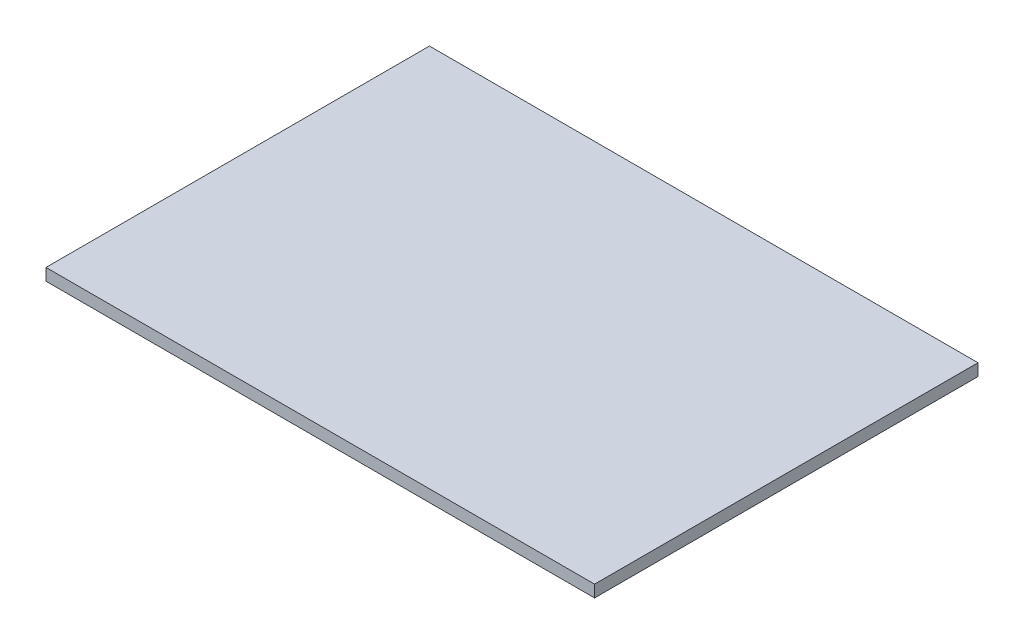
ISO-10303-21;
HEADER;
FILE_DESCRIPTION(('STEP AP214'),'2;1');
FILE_NAME('part.step','',(''),(''),'','','');
FILE_SCHEMA(('AUTOMOTIVE_DESIGN { 1 0 10303 214 1 1 1 1 }'));
ENDSEC;
DATA;
#1=APPLICATION_CONTEXT('core data for automotive mechanical design processes');
#2=APPLICATION_PROTOCOL_DEFINITION('international standard','automotive_design',2000,#1);
#3=PRODUCT_CONTEXT('',#1,'mechanical');
#4=PRODUCT('Part','Part','',(#3));
#5=PRODUCT_RELATED_PRODUCT_CATEGORY('part','',(#4));
#6=PRODUCT_DEFINITION_FORMATION('','',#4);
#7=PRODUCT_DEFINITION_CONTEXT('part definition',#1,'design');
#8=PRODUCT_DEFINITION('design','',#6,#7);
#9=PRODUCT_DEFINITION_SHAPE('','',#8);
#10=(LENGTH_UNIT() NAMED_UNIT(*) SI_UNIT(.MILLI.,.METRE.));
#11=(NAMED_UNIT(*) PLANE_ANGLE_UNIT() SI_UNIT($,.RADIAN.));
#12=(NAMED_UNIT(*) SI_UNIT($,.STERADIAN.) SOLID_ANGLE_UNIT());
#13=UNCERTAINTY_MEASURE_WITH_UNIT(LENGTH_MEASURE(1.E-05),#10,'distance_accuracy_value','');
#14=(GEOMETRIC_REPRESENTATION_CONTEXT(3) GLOBAL_UNCERTAINTY_ASSIGNED_CONTEXT((#13)) GLOBAL_UNIT_ASSIGNED_CONTEXT((#10,
#11,#12)) REPRESENTATION_CONTEXT('',''));
#15=CARTESIAN_POINT('',(0.,0.,0.));
#16=DIRECTION('',(0.,0.,1.));
#17=DIRECTION('',(1.,0.,0.));
#18=AXIS2_PLACEMENT_3D('',#15,#16,#17);
#19=CARTESIAN_POINT('',(39.8520726672004,1.5875,10.7330093069058));
#20=DIRECTION('',(-1.,0.,0.));
#21=DIRECTION('',(0.,0.,1.));
#22=AXIS2_PLACEMENT_3D('',#19,#20,#21);
#23=PLANE('',#22);
#24=DIRECTION('',(0.,0.,-1.));
#25=VECTOR('',#24,1.);
#26=CARTESIAN_POINT('',(39.8520726672004,0.,10.7330093069058));
#27=LINE('',#26,#25);
#28=CARTESIAN_POINT('',(39.8520726672004,0.,61.5330093069058));
#29=VERTEX_POINT('',#28);
#30=CARTESIAN_POINT('',(39.8520726672004,0.,10.7330093069058));
#31=VERTEX_POINT('',#30);
#32=EDGE_CURVE('E97',#29,#31,#27,.T.);
#33=ORIENTED_EDGE('',*,*,#32,.T.);
#34=DIRECTION('',(0.,-1.,0.));
#35=VECTOR('',#34,1.);
#36=CARTESIAN_POINT('',(39.8520726672004,1.5875,10.7330093069058));
#37=LINE('',#36,#35);
#38=CARTESIAN_POINT('',(39.8520726672004,1.5875,10.7330093069058));
#39=VERTEX_POINT('',#38);
#40=EDGE_CURVE('E11',#39,#31,#37,.T.);
#41=ORIENTED_EDGE('',*,*,#40,.F.);
#42=DIRECTION('',(0.,0.,-1.));
#43=VECTOR('',#42,1.);
#44=CARTESIAN_POINT('',(39.8520726672004,1.5875,10.7330093069058));
#45=LINE('',#44,#43);
#46=CARTESIAN_POINT('',(39.8520726672004,1.5875,61.5330093069058));
#47=VERTEX_POINT('',#46);
#48=EDGE_CURVE('E85',#47,#39,#45,.T.);
#49=ORIENTED_EDGE('',*,*,#48,.F.);
#50=DIRECTION('',(0.,-1.,0.));
#51=VECTOR('',#50,1.);
#52=CARTESIAN_POINT('',(39.8520726672004,1.5875,61.5330093069058));
#53=LINE('',#52,#51);
#54=EDGE_CURVE('E93',#47,#29,#53,.T.);
#55=ORIENTED_EDGE('',*,*,#54,.T.);
#56=EDGE_LOOP('',(#33,#41,#49,#55));
#57=FACE_BOUND('',#56,.T.);
#58=ADVANCED_FACE('F34',(#57),#23,.F.);
#59=CARTESIAN_POINT('',(-32.8229273327997,1.5875,10.7330093069059));
#60=DIRECTION('',(0.,0.,1.));
#61=DIRECTION('',(1.,0.,0.));
#62=AXIS2_PLACEMENT_3D('',#59,#60,#61);
#63=PLANE('',#62);
#64=DIRECTION('',(-1.,0.,0.));
#65=VECTOR('',#64,1.);
#66=CARTESIAN_POINT('',(-32.8229273327997,0.,10.7330093069059));
#67=LINE('',#66,#65);
#68=CARTESIAN_POINT('',(-32.8229273327997,0.,10.7330093069059));
#69=VERTEX_POINT('',#68);
#70=EDGE_CURVE('E89',#31,#69,#67,.T.);
#71=ORIENTED_EDGE('',*,*,#70,.T.);
#72=DIRECTION('',(0.,-1.,0.));
#73=VECTOR('',#72,1.);
#74=CARTESIAN_POINT('',(-32.8229273327997,1.5875,10.7330093069059));
#75=LINE('',#74,#73);
#76=CARTESIAN_POINT('',(-32.8229273327997,1.5875,10.7330093069059));
#77=VERTEX_POINT('',#76);
#78=EDGE_CURVE('E42',#77,#69,#75,.T.);
#79=ORIENTED_EDGE('',*,*,#78,.F.);
#80=DIRECTION('',(-1.,0.,0.));
#81=VECTOR('',#80,1.);
#82=CARTESIAN_POINT('',(-32.8229273327997,1.5875,10.7330093069059));
#83=LINE('',#82,#81);
#84=EDGE_CURVE('E80',#39,#77,#83,.T.);
#85=ORIENTED_EDGE('',*,*,#84,.F.);
#86=ORIENTED_EDGE('',*,*,#40,.T.);
#87=EDGE_LOOP('',(#71,#79,#85,#86));
#88=FACE_BOUND('',#87,.T.);
#89=ADVANCED_FACE('F88',(#88),#63,.F.);
#90=CARTESIAN_POINT('',(-32.8229273327997,1.5875,10.7330093069059));
#91=DIRECTION('',(1.,0.,0.));
#92=DIRECTION('',(0.,0.,-1.));
#93=AXIS2_PLACEMENT_3D('',#90,#91,#92);
#94=PLANE('',#93);
#95=DIRECTION('',(0.,0.,1.));
#96=VECTOR('',#95,1.);
#97=CARTESIAN_POINT('',(-32.8229273327997,0.,10.7330093069059));
#98=LINE('',#97,#96);
#99=CARTESIAN_POINT('',(-32.8229273327997,0.,61.5330093069058));
#100=VERTEX_POINT('',#99);
#101=EDGE_CURVE('E67',#69,#100,#98,.T.);
#102=ORIENTED_EDGE('',*,*,#101,.T.);
#103=DIRECTION('',(0.,-1.,0.));
#104=VECTOR('',#103,1.);
#105=CARTESIAN_POINT('',(-32.8229273327997,1.5875,61.5330093069058));
#106=LINE('',#105,#104);
#107=CARTESIAN_POINT('',(-32.8229273327997,1.5875,61.5330093069058));
#108=VERTEX_POINT('',#107);
#109=EDGE_CURVE('E90',#108,#100,#106,.T.);
#110=ORIENTED_EDGE('',*,*,#109,.F.);
#111=DIRECTION('',(0.,0.,1.));
#112=VECTOR('',#111,1.);
#113=CARTESIAN_POINT('',(-32.8229273327997,1.5875,10.7330093069059));
#114=LINE('',#113,#112);
#115=EDGE_CURVE('E83',#77,#108,#114,.T.);
#116=ORIENTED_EDGE('',*,*,#115,.F.);
#117=ORIENTED_EDGE('',*,*,#78,.T.);
#118=EDGE_LOOP('',(#102,#110,#116,#117));
#119=FACE_BOUND('',#118,.T.);
#120=ADVANCED_FACE('F91',(#119),#94,.F.);
#121=CARTESIAN_POINT('',(-32.8229273327997,1.5875,61.5330093069058));
#122=DIRECTION('',(0.,0.,-1.));
#123=DIRECTION('',(-1.,0.,0.));
#124=AXIS2_PLACEMENT_3D('',#121,#122,#123);
#125=PLANE('',#124);
#126=DIRECTION('',(1.,0.,0.));
#127=VECTOR('',#126,1.);
#128=CARTESIAN_POINT('',(-32.8229273327997,0.,61.5330093069058));
#129=LINE('',#128,#127);
#130=EDGE_CURVE('E73',#100,#29,#129,.T.);
#131=ORIENTED_EDGE('',*,*,#130,.T.);
#132=ORIENTED_EDGE('',*,*,#54,.F.);
#133=DIRECTION('',(1.,0.,0.));
#134=VECTOR('',#133,1.);
#135=CARTESIAN_POINT('',(-32.8229273327997,1.5875,61.5330093069058));
#136=LINE('',#135,#134);
#137=EDGE_CURVE('E50',#108,#47,#136,.T.);
#138=ORIENTED_EDGE('',*,*,#137,.F.);
#139=ORIENTED_EDGE('',*,*,#109,.T.);
#140=EDGE_LOOP('',(#131,#132,#138,#139));
#141=FACE_BOUND('',#140,.T.);
#142=ADVANCED_FACE('F104',(#141),#125,.F.);
#143=CARTESIAN_POINT('',(0.,1.5875,0.));
#144=DIRECTION('',(0.,1.,0.));
#145=DIRECTION('',(0.,0.,1.));
#146=AXIS2_PLACEMENT_3D('',#143,#144,#145);
#147=PLANE('',#146);
#148=ORIENTED_EDGE('',*,*,#48,.T.);
#149=ORIENTED_EDGE('',*,*,#84,.T.);
#150=ORIENTED_EDGE('',*,*,#115,.T.);
#151=ORIENTED_EDGE('',*,*,#137,.T.);
#152=EDGE_LOOP('',(#148,#149,#150,#151));
#153=FACE_BOUND('',#152,.T.);
#154=ADVANCED_FACE('F81',(#153),#147,.T.);
#155=CARTESIAN_POINT('',(0.,0.,0.));
#156=DIRECTION('',(0.,1.,0.));
#157=DIRECTION('',(0.,0.,1.));
#158=AXIS2_PLACEMENT_3D('',#155,#156,#157);
#159=PLANE('',#158);
#160=ORIENTED_EDGE('',*,*,#32,.F.);
#161=ORIENTED_EDGE('',*,*,#130,.F.);
#162=ORIENTED_EDGE('',*,*,#101,.F.);
#163=ORIENTED_EDGE('',*,*,#70,.F.);
#164=EDGE_LOOP('',(#160,#161,#162,#163));
#165=FACE_BOUND('',#164,.T.);
#166=ADVANCED_FACE('F107',(#165),#159,.F.);
#167=CLOSED_SHELL('',(#58,#89,#120,#142,#154,#166));
#168=MANIFOLD_SOLID_BREP('B2',#167);
#169=ADVANCED_BREP_SHAPE_REPRESENTATION('',(#18,#168),#14);
#170=SHAPE_DEFINITION_REPRESENTATION(#9,#169);
ENDSEC;
END-ISO-10303-21;
